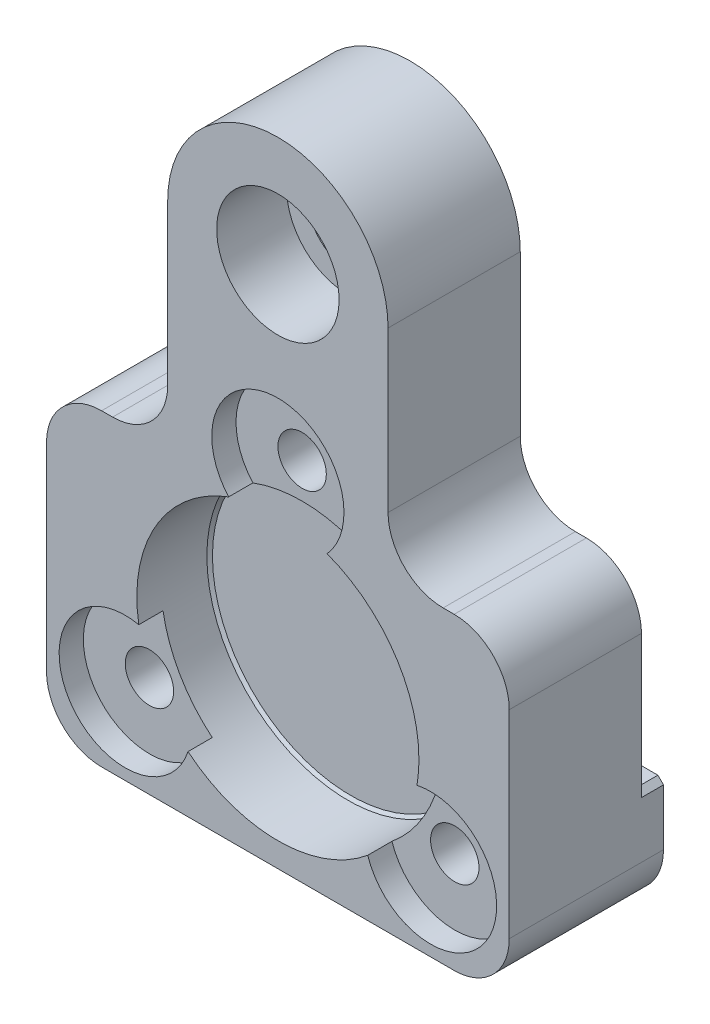
ISO-10303-21;
HEADER;
FILE_DESCRIPTION(('STEP AP214'),'2;1');
FILE_NAME('part.step','',(''),(''),'','','');
FILE_SCHEMA(('AUTOMOTIVE_DESIGN { 1 0 10303 214 1 1 1 1 }'));
ENDSEC;
DATA;
#1=APPLICATION_CONTEXT('core data for automotive mechanical design processes');
#2=APPLICATION_PROTOCOL_DEFINITION('international standard','automotive_design',2000,#1);
#3=PRODUCT_CONTEXT('',#1,'mechanical');
#4=PRODUCT('Part','Part','',(#3));
#5=PRODUCT_RELATED_PRODUCT_CATEGORY('part','',(#4));
#6=PRODUCT_DEFINITION_FORMATION('','',#4);
#7=PRODUCT_DEFINITION_CONTEXT('part definition',#1,'design');
#8=PRODUCT_DEFINITION('design','',#6,#7);
#9=PRODUCT_DEFINITION_SHAPE('','',#8);
#10=(LENGTH_UNIT() NAMED_UNIT(*) SI_UNIT(.MILLI.,.METRE.));
#11=(NAMED_UNIT(*) PLANE_ANGLE_UNIT() SI_UNIT($,.RADIAN.));
#12=(NAMED_UNIT(*) SI_UNIT($,.STERADIAN.) SOLID_ANGLE_UNIT());
#13=UNCERTAINTY_MEASURE_WITH_UNIT(LENGTH_MEASURE(1.E-05),#10,'distance_accuracy_value','');
#14=(GEOMETRIC_REPRESENTATION_CONTEXT(3) GLOBAL_UNCERTAINTY_ASSIGNED_CONTEXT((#13)) GLOBAL_UNIT_ASSIGNED_CONTEXT((#10,
#11,#12)) REPRESENTATION_CONTEXT('',''));
#15=CARTESIAN_POINT('',(0.,0.,0.));
#16=DIRECTION('',(0.,0.,1.));
#17=DIRECTION('',(1.,0.,0.));
#18=AXIS2_PLACEMENT_3D('',#15,#16,#17);
#19=CARTESIAN_POINT('',(-15.,18.,14.));
#20=DIRECTION('',(0.,0.,-1.));
#21=DIRECTION('',(-1.,0.,0.));
#22=AXIS2_PLACEMENT_3D('',#19,#20,#21);
#23=CYLINDRICAL_SURFACE('',#22,5.);
#24=CARTESIAN_POINT('',(-15.,18.,2.));
#25=DIRECTION('',(0.,0.,-1.));
#26=DIRECTION('',(-1.,0.,0.));
#27=AXIS2_PLACEMENT_3D('',#24,#25,#26);
#28=CIRCLE('',#27,5.);
#29=CARTESIAN_POINT('',(-15.,13.,2.));
#30=VERTEX_POINT('',#29);
#31=CARTESIAN_POINT('',(-10.,18.,2.));
#32=VERTEX_POINT('',#31);
#33=EDGE_CURVE('E201',#30,#32,#28,.F.);
#34=ORIENTED_EDGE('',*,*,#33,.F.);
#35=DIRECTION('',(0.,0.,-1.));
#36=VECTOR('',#35,1.);
#37=CARTESIAN_POINT('',(-15.,13.,14.));
#38=LINE('',#37,#36);
#39=CARTESIAN_POINT('',(-15.,13.,14.));
#40=VERTEX_POINT('',#39);
#41=EDGE_CURVE('E241',#40,#30,#38,.T.);
#42=ORIENTED_EDGE('',*,*,#41,.F.);
#43=CARTESIAN_POINT('',(-15.,18.,14.));
#44=DIRECTION('',(0.,0.,-1.));
#45=DIRECTION('',(1.,0.,0.));
#46=AXIS2_PLACEMENT_3D('',#43,#44,#45);
#47=CIRCLE('',#46,5.);
#48=CARTESIAN_POINT('',(-10.,18.,14.));
#49=VERTEX_POINT('',#48);
#50=EDGE_CURVE('E391',#49,#40,#47,.T.);
#51=ORIENTED_EDGE('',*,*,#50,.F.);
#52=DIRECTION('',(0.,0.,-1.));
#53=VECTOR('',#52,1.);
#54=CARTESIAN_POINT('',(-10.,18.,14.));
#55=LINE('',#54,#53);
#56=EDGE_CURVE('E420',#49,#32,#55,.T.);
#57=ORIENTED_EDGE('',*,*,#56,.T.);
#58=EDGE_LOOP('',(#34,#42,#51,#57));
#59=FACE_BOUND('',#58,.T.);
#60=ADVANCED_FACE('F33',(#59),#23,.F.);
#61=CARTESIAN_POINT('',(-16.,13.,14.));
#62=DIRECTION('',(0.,-1.,0.));
#63=DIRECTION('',(1.,0.,0.));
#64=AXIS2_PLACEMENT_3D('',#61,#62,#63);
#65=PLANE('',#64);
#66=DIRECTION('',(1.,0.,0.));
#67=VECTOR('',#66,1.);
#68=CARTESIAN_POINT('',(-16.,13.,2.));
#69=LINE('',#68,#67);
#70=CARTESIAN_POINT('',(-16.,13.,2.));
#71=VERTEX_POINT('',#70);
#72=EDGE_CURVE('E345',#71,#30,#69,.T.);
#73=ORIENTED_EDGE('',*,*,#72,.F.);
#74=DIRECTION('',(0.,0.,-1.));
#75=VECTOR('',#74,1.);
#76=CARTESIAN_POINT('',(-16.,13.,14.));
#77=LINE('',#76,#75);
#78=CARTESIAN_POINT('',(-16.,13.,14.));
#79=VERTEX_POINT('',#78);
#80=EDGE_CURVE('E238',#79,#71,#77,.T.);
#81=ORIENTED_EDGE('',*,*,#80,.F.);
#82=DIRECTION('',(-1.,0.,0.));
#83=VECTOR('',#82,1.);
#84=CARTESIAN_POINT('',(-16.,13.,14.));
#85=LINE('',#84,#83);
#86=EDGE_CURVE('E394',#40,#79,#85,.T.);
#87=ORIENTED_EDGE('',*,*,#86,.F.);
#88=ORIENTED_EDGE('',*,*,#41,.T.);
#89=EDGE_LOOP('',(#73,#81,#87,#88));
#90=FACE_BOUND('',#89,.T.);
#91=ADVANCED_FACE('F302',(#90),#65,.F.);
#92=CARTESIAN_POINT('',(-16.,8.,14.));
#93=DIRECTION('',(0.,0.,-1.));
#94=DIRECTION('',(-1.,0.,0.));
#95=AXIS2_PLACEMENT_3D('',#92,#93,#94);
#96=CYLINDRICAL_SURFACE('',#95,5.);
#97=CARTESIAN_POINT('',(-16.,8.,2.));
#98=DIRECTION('',(0.,0.,-1.));
#99=DIRECTION('',(-1.,0.,0.));
#100=AXIS2_PLACEMENT_3D('',#97,#98,#99);
#101=CIRCLE('',#100,5.);
#102=CARTESIAN_POINT('',(-21.,8.,2.));
#103=VERTEX_POINT('',#102);
#104=EDGE_CURVE('E347',#103,#71,#101,.T.);
#105=ORIENTED_EDGE('',*,*,#104,.F.);
#106=DIRECTION('',(0.,0.,-1.));
#107=VECTOR('',#106,1.);
#108=CARTESIAN_POINT('',(-21.,8.,14.));
#109=LINE('',#108,#107);
#110=CARTESIAN_POINT('',(-21.,8.,14.));
#111=VERTEX_POINT('',#110);
#112=EDGE_CURVE('E236',#111,#103,#109,.T.);
#113=ORIENTED_EDGE('',*,*,#112,.F.);
#114=CARTESIAN_POINT('',(-16.,8.,14.));
#115=DIRECTION('',(0.,0.,1.));
#116=DIRECTION('',(-1.,0.,0.));
#117=AXIS2_PLACEMENT_3D('',#114,#115,#116);
#118=CIRCLE('',#117,5.);
#119=EDGE_CURVE('E397',#79,#111,#118,.T.);
#120=ORIENTED_EDGE('',*,*,#119,.F.);
#121=ORIENTED_EDGE('',*,*,#80,.T.);
#122=EDGE_LOOP('',(#105,#113,#120,#121));
#123=FACE_BOUND('',#122,.T.);
#124=ADVANCED_FACE('F308',(#123),#96,.T.);
#125=CARTESIAN_POINT('',(16.,8.,14.));
#126=DIRECTION('',(0.,0.,-1.));
#127=DIRECTION('',(-1.,0.,0.));
#128=AXIS2_PLACEMENT_3D('',#125,#126,#127);
#129=CYLINDRICAL_SURFACE('',#128,5.);
#130=CARTESIAN_POINT('',(16.,8.,2.));
#131=DIRECTION('',(0.,0.,-1.));
#132=DIRECTION('',(-1.,0.,0.));
#133=AXIS2_PLACEMENT_3D('',#130,#131,#132);
#134=CIRCLE('',#133,5.);
#135=CARTESIAN_POINT('',(16.,13.,2.));
#136=VERTEX_POINT('',#135);
#137=CARTESIAN_POINT('',(21.,8.,2.));
#138=VERTEX_POINT('',#137);
#139=EDGE_CURVE('E193',#136,#138,#134,.T.);
#140=ORIENTED_EDGE('',*,*,#139,.F.);
#141=DIRECTION('',(0.,0.,-1.));
#142=VECTOR('',#141,1.);
#143=CARTESIAN_POINT('',(16.,13.,14.));
#144=LINE('',#143,#142);
#145=CARTESIAN_POINT('',(16.,13.,14.));
#146=VERTEX_POINT('',#145);
#147=EDGE_CURVE('E219',#146,#136,#144,.T.);
#148=ORIENTED_EDGE('',*,*,#147,.F.);
#149=CARTESIAN_POINT('',(16.,8.,14.));
#150=DIRECTION('',(0.,0.,1.));
#151=DIRECTION('',(-1.,0.,0.));
#152=AXIS2_PLACEMENT_3D('',#149,#150,#151);
#153=CIRCLE('',#152,5.);
#154=CARTESIAN_POINT('',(21.,8.00000000000001,14.));
#155=VERTEX_POINT('',#154);
#156=EDGE_CURVE('E217',#155,#146,#153,.T.);
#157=ORIENTED_EDGE('',*,*,#156,.F.);
#158=DIRECTION('',(0.,0.,-1.));
#159=VECTOR('',#158,1.);
#160=CARTESIAN_POINT('',(21.,8.00000000000001,14.));
#161=LINE('',#160,#159);
#162=EDGE_CURVE('E208',#155,#138,#161,.T.);
#163=ORIENTED_EDGE('',*,*,#162,.T.);
#164=EDGE_LOOP('',(#140,#148,#157,#163));
#165=FACE_BOUND('',#164,.T.);
#166=ADVANCED_FACE('F216',(#165),#129,.T.);
#167=CARTESIAN_POINT('',(15.,13.,14.));
#168=DIRECTION('',(0.,-1.,0.));
#169=DIRECTION('',(1.,0.,0.));
#170=AXIS2_PLACEMENT_3D('',#167,#168,#169);
#171=PLANE('',#170);
#172=DIRECTION('',(1.,0.,0.));
#173=VECTOR('',#172,1.);
#174=CARTESIAN_POINT('',(15.,13.,2.));
#175=LINE('',#174,#173);
#176=CARTESIAN_POINT('',(15.,13.,2.));
#177=VERTEX_POINT('',#176);
#178=EDGE_CURVE('E196',#177,#136,#175,.T.);
#179=ORIENTED_EDGE('',*,*,#178,.F.);
#180=DIRECTION('',(0.,0.,-1.));
#181=VECTOR('',#180,1.);
#182=CARTESIAN_POINT('',(15.,13.,14.));
#183=LINE('',#182,#181);
#184=CARTESIAN_POINT('',(15.,13.,14.));
#185=VERTEX_POINT('',#184);
#186=EDGE_CURVE('E224',#185,#177,#183,.T.);
#187=ORIENTED_EDGE('',*,*,#186,.F.);
#188=DIRECTION('',(-1.,0.,0.));
#189=VECTOR('',#188,1.);
#190=CARTESIAN_POINT('',(15.,13.,14.));
#191=LINE('',#190,#189);
#192=EDGE_CURVE('E410',#146,#185,#191,.T.);
#193=ORIENTED_EDGE('',*,*,#192,.F.);
#194=ORIENTED_EDGE('',*,*,#147,.T.);
#195=EDGE_LOOP('',(#179,#187,#193,#194));
#196=FACE_BOUND('',#195,.T.);
#197=ADVANCED_FACE('F448',(#196),#171,.F.);
#198=CARTESIAN_POINT('',(15.,18.,14.));
#199=DIRECTION('',(0.,0.,-1.));
#200=DIRECTION('',(-1.,0.,0.));
#201=AXIS2_PLACEMENT_3D('',#198,#199,#200);
#202=CYLINDRICAL_SURFACE('',#201,5.);
#203=CARTESIAN_POINT('',(15.,18.,2.));
#204=DIRECTION('',(0.,0.,-1.));
#205=DIRECTION('',(-1.,0.,0.));
#206=AXIS2_PLACEMENT_3D('',#203,#204,#205);
#207=CIRCLE('',#206,5.);
#208=CARTESIAN_POINT('',(10.,18.,2.));
#209=VERTEX_POINT('',#208);
#210=EDGE_CURVE('E341',#209,#177,#207,.F.);
#211=ORIENTED_EDGE('',*,*,#210,.F.);
#212=DIRECTION('',(0.,0.,-1.));
#213=VECTOR('',#212,1.);
#214=CARTESIAN_POINT('',(10.,18.,14.));
#215=LINE('',#214,#213);
#216=CARTESIAN_POINT('',(10.,18.,14.));
#217=VERTEX_POINT('',#216);
#218=EDGE_CURVE('E437',#217,#209,#215,.T.);
#219=ORIENTED_EDGE('',*,*,#218,.F.);
#220=CARTESIAN_POINT('',(15.,18.,14.));
#221=DIRECTION('',(0.,0.,-1.));
#222=DIRECTION('',(1.,0.,0.));
#223=AXIS2_PLACEMENT_3D('',#220,#221,#222);
#224=CIRCLE('',#223,5.);
#225=EDGE_CURVE('E412',#185,#217,#224,.T.);
#226=ORIENTED_EDGE('',*,*,#225,.F.);
#227=ORIENTED_EDGE('',*,*,#186,.T.);
#228=EDGE_LOOP('',(#211,#219,#226,#227));
#229=FACE_BOUND('',#228,.T.);
#230=ADVANCED_FACE('F444',(#229),#202,.F.);
#231=CARTESIAN_POINT('',(10.,32.5,14.));
#232=DIRECTION('',(-1.,0.,0.));
#233=DIRECTION('',(0.,-1.,0.));
#234=AXIS2_PLACEMENT_3D('',#231,#232,#233);
#235=PLANE('',#234);
#236=DIRECTION('',(0.,-1.,0.));
#237=VECTOR('',#236,1.);
#238=CARTESIAN_POINT('',(10.,32.5,2.));
#239=LINE('',#238,#237);
#240=CARTESIAN_POINT('',(10.,32.5,2.));
#241=VERTEX_POINT('',#240);
#242=EDGE_CURVE('E339',#241,#209,#239,.T.);
#243=ORIENTED_EDGE('',*,*,#242,.F.);
#244=DIRECTION('',(0.,0.,-1.));
#245=VECTOR('',#244,1.);
#246=CARTESIAN_POINT('',(10.,32.5,14.));
#247=LINE('',#246,#245);
#248=CARTESIAN_POINT('',(10.,32.5,14.));
#249=VERTEX_POINT('',#248);
#250=EDGE_CURVE('E434',#249,#241,#247,.T.);
#251=ORIENTED_EDGE('',*,*,#250,.F.);
#252=DIRECTION('',(0.,1.,0.));
#253=VECTOR('',#252,1.);
#254=CARTESIAN_POINT('',(10.,32.5,14.));
#255=LINE('',#254,#253);
#256=EDGE_CURVE('E414',#217,#249,#255,.T.);
#257=ORIENTED_EDGE('',*,*,#256,.F.);
#258=ORIENTED_EDGE('',*,*,#218,.T.);
#259=EDGE_LOOP('',(#243,#251,#257,#258));
#260=FACE_BOUND('',#259,.T.);
#261=ADVANCED_FACE('F488',(#260),#235,.F.);
#262=CARTESIAN_POINT('',(0.,32.5,14.));
#263=DIRECTION('',(0.,0.,-1.));
#264=DIRECTION('',(-1.,0.,0.));
#265=AXIS2_PLACEMENT_3D('',#262,#263,#264);
#266=CYLINDRICAL_SURFACE('',#265,10.);
#267=ORIENTED_EDGE('',*,*,#250,.T.);
#268=CARTESIAN_POINT('',(0.,32.5,2.));
#269=DIRECTION('',(0.,0.,-1.));
#270=DIRECTION('',(-1.,0.,0.));
#271=AXIS2_PLACEMENT_3D('',#268,#269,#270);
#272=CIRCLE('',#271,10.);
#273=CARTESIAN_POINT('',(-10.,32.5,2.));
#274=VERTEX_POINT('',#273);
#275=EDGE_CURVE('E337',#274,#241,#272,.T.);
#276=ORIENTED_EDGE('',*,*,#275,.F.);
#277=DIRECTION('',(0.,0.,-1.));
#278=VECTOR('',#277,1.);
#279=CARTESIAN_POINT('',(-10.,32.5,14.));
#280=LINE('',#279,#278);
#281=CARTESIAN_POINT('',(-10.,32.5,14.));
#282=VERTEX_POINT('',#281);
#283=EDGE_CURVE('E431',#282,#274,#280,.T.);
#284=ORIENTED_EDGE('',*,*,#283,.F.);
#285=CARTESIAN_POINT('',(0.,32.5,14.));
#286=DIRECTION('',(0.,0.,1.));
#287=DIRECTION('',(1.,0.,0.));
#288=AXIS2_PLACEMENT_3D('',#285,#286,#287);
#289=CIRCLE('',#288,10.);
#290=EDGE_CURVE('E416',#249,#282,#289,.T.);
#291=ORIENTED_EDGE('',*,*,#290,.F.);
#292=EDGE_LOOP('',(#267,#276,#284,#291));
#293=FACE_BOUND('',#292,.T.);
#294=ADVANCED_FACE('F483',(#293),#266,.T.);
#295=CARTESIAN_POINT('',(-10.,18.,14.));
#296=DIRECTION('',(1.,0.,0.));
#297=DIRECTION('',(0.,1.,0.));
#298=AXIS2_PLACEMENT_3D('',#295,#296,#297);
#299=PLANE('',#298);
#300=DIRECTION('',(0.,1.,0.));
#301=VECTOR('',#300,1.);
#302=CARTESIAN_POINT('',(-10.,18.,2.));
#303=LINE('',#302,#301);
#304=EDGE_CURVE('E335',#32,#274,#303,.T.);
#305=ORIENTED_EDGE('',*,*,#304,.F.);
#306=ORIENTED_EDGE('',*,*,#56,.F.);
#307=DIRECTION('',(0.,-1.,0.));
#308=VECTOR('',#307,1.);
#309=CARTESIAN_POINT('',(-10.,18.,14.));
#310=LINE('',#309,#308);
#311=EDGE_CURVE('E418',#282,#49,#310,.T.);
#312=ORIENTED_EDGE('',*,*,#311,.F.);
#313=ORIENTED_EDGE('',*,*,#283,.T.);
#314=EDGE_LOOP('',(#305,#306,#312,#313));
#315=FACE_BOUND('',#314,.T.);
#316=ADVANCED_FACE('F478',(#315),#299,.F.);
#317=CARTESIAN_POINT('',(0.,32.5,14.));
#318=DIRECTION('',(0.,0.,1.));
#319=DIRECTION('',(1.,0.,0.));
#320=AXIS2_PLACEMENT_3D('',#317,#318,#319);
#321=CYLINDRICAL_SURFACE('',#320,3.57124);
#322=CARTESIAN_POINT('',(0.,32.5,7.65));
#323=DIRECTION('',(0.,0.,1.));
#324=DIRECTION('',(1.,0.,0.));
#325=AXIS2_PLACEMENT_3D('',#322,#323,#324);
#326=CIRCLE('',#325,3.57124);
#327=CARTESIAN_POINT('',(3.57124,32.5,7.65));
#328=VERTEX_POINT('',#327);
#329=EDGE_CURVE('E382',#328,#328,#326,.T.);
#330=ORIENTED_EDGE('',*,*,#329,.T.);
#331=EDGE_LOOP('',(#330));
#332=FACE_BOUND('',#331,.T.);
#333=CARTESIAN_POINT('',(0.,32.5,2.));
#334=DIRECTION('',(0.,0.,-1.));
#335=DIRECTION('',(-1.,0.,0.));
#336=AXIS2_PLACEMENT_3D('',#333,#334,#335);
#337=CIRCLE('',#336,3.57124);
#338=CARTESIAN_POINT('',(-3.57124,32.5,2.));
#339=VERTEX_POINT('',#338);
#340=EDGE_CURVE('E272',#339,#339,#337,.F.);
#341=ORIENTED_EDGE('',*,*,#340,.F.);
#342=EDGE_LOOP('',(#341));
#343=FACE_BOUND('',#342,.T.);
#344=ADVANCED_FACE('F554',(#332,#343),#321,.F.);
#345=CARTESIAN_POINT('',(0.,16.,11.8));
#346=DIRECTION('',(0.,0.,1.));
#347=DIRECTION('',(1.,0.,0.));
#348=AXIS2_PLACEMENT_3D('',#345,#346,#347);
#349=CYLINDRICAL_SURFACE('',#348,2.1971);
#350=CARTESIAN_POINT('',(0.,16.,11.8));
#351=DIRECTION('',(0.,0.,1.));
#352=DIRECTION('',(1.,0.,0.));
#353=AXIS2_PLACEMENT_3D('',#350,#351,#352);
#354=CIRCLE('',#353,2.1971);
#355=CARTESIAN_POINT('',(2.1971,16.,11.8));
#356=VERTEX_POINT('',#355);
#357=EDGE_CURVE('E349',#356,#356,#354,.T.);
#358=ORIENTED_EDGE('',*,*,#357,.T.);
#359=EDGE_LOOP('',(#358));
#360=FACE_BOUND('',#359,.T.);
#361=CARTESIAN_POINT('',(0.,16.,2.));
#362=DIRECTION('',(0.,0.,-1.));
#363=DIRECTION('',(-1.,0.,0.));
#364=AXIS2_PLACEMENT_3D('',#361,#362,#363);
#365=CIRCLE('',#364,2.1971);
#366=CARTESIAN_POINT('',(-2.1971,16.,2.));
#367=VERTEX_POINT('',#366);
#368=EDGE_CURVE('E269',#367,#367,#365,.F.);
#369=ORIENTED_EDGE('',*,*,#368,.F.);
#370=EDGE_LOOP('',(#369));
#371=FACE_BOUND('',#370,.T.);
#372=ADVANCED_FACE('F517',(#360,#371),#349,.F.);
#373=CARTESIAN_POINT('',(-21.,8.,14.));
#374=DIRECTION('',(1.,0.,0.));
#375=DIRECTION('',(0.,0.,-1.));
#376=AXIS2_PLACEMENT_3D('',#373,#374,#375);
#377=PLANE('',#376);
#378=DIRECTION('',(0.,1.,0.));
#379=VECTOR('',#378,1.);
#380=CARTESIAN_POINT('',(-21.,42.5,2.));
#381=LINE('',#380,#379);
#382=CARTESIAN_POINT('',(-21.,-4.90799999999999,2.));
#383=VERTEX_POINT('',#382);
#384=EDGE_CURVE('E48',#383,#103,#381,.T.);
#385=ORIENTED_EDGE('',*,*,#384,.F.);
#386=DIRECTION('',(0.,0.,-1.));
#387=VECTOR('',#386,1.);
#388=CARTESIAN_POINT('',(-21.,-4.90799999999999,14.));
#389=LINE('',#388,#387);
#390=CARTESIAN_POINT('',(-21.,-4.90799999999998,0.));
#391=VERTEX_POINT('',#390);
#392=EDGE_CURVE('E282',#383,#391,#389,.T.);
#393=ORIENTED_EDGE('',*,*,#392,.T.);
#394=DIRECTION('',(0.,-1.,0.));
#395=VECTOR('',#394,1.);
#396=CARTESIAN_POINT('',(-21.,8.,0.));
#397=LINE('',#396,#395);
#398=CARTESIAN_POINT('',(-21.,-10.,0.));
#399=VERTEX_POINT('',#398);
#400=EDGE_CURVE('E389',#391,#399,#397,.T.);
#401=ORIENTED_EDGE('',*,*,#400,.T.);
#402=DIRECTION('',(0.,0.,-1.));
#403=VECTOR('',#402,1.);
#404=CARTESIAN_POINT('',(-21.,-10.,14.));
#405=LINE('',#404,#403);
#406=CARTESIAN_POINT('',(-21.,-10.,14.));
#407=VERTEX_POINT('',#406);
#408=EDGE_CURVE('E233',#407,#399,#405,.T.);
#409=ORIENTED_EDGE('',*,*,#408,.F.);
#410=DIRECTION('',(0.,-1.,0.));
#411=VECTOR('',#410,1.);
#412=CARTESIAN_POINT('',(-21.,8.,14.));
#413=LINE('',#412,#411);
#414=EDGE_CURVE('E399',#111,#407,#413,.T.);
#415=ORIENTED_EDGE('',*,*,#414,.F.);
#416=ORIENTED_EDGE('',*,*,#112,.T.);
#417=EDGE_LOOP('',(#385,#393,#401,#409,#415,#416));
#418=FACE_BOUND('',#417,.T.);
#419=ADVANCED_FACE('F468',(#418),#377,.F.);
#420=CARTESIAN_POINT('',(-16.,-10.,14.));
#421=DIRECTION('',(0.,0.,-1.));
#422=DIRECTION('',(-1.,0.,0.));
#423=AXIS2_PLACEMENT_3D('',#420,#421,#422);
#424=CYLINDRICAL_SURFACE('',#423,5.);
#425=CARTESIAN_POINT('',(-16.,-10.,0.));
#426=DIRECTION('',(0.,0.,1.));
#427=DIRECTION('',(1.,0.,0.));
#428=AXIS2_PLACEMENT_3D('',#425,#426,#427);
#429=CIRCLE('',#428,5.);
#430=CARTESIAN_POINT('',(-16.,-15.,0.));
#431=VERTEX_POINT('',#430);
#432=EDGE_CURVE('E422',#399,#431,#429,.T.);
#433=ORIENTED_EDGE('',*,*,#432,.T.);
#434=DIRECTION('',(0.,0.,-1.));
#435=VECTOR('',#434,1.);
#436=CARTESIAN_POINT('',(-16.,-15.,14.));
#437=LINE('',#436,#435);
#438=CARTESIAN_POINT('',(-16.,-15.,14.));
#439=VERTEX_POINT('',#438);
#440=EDGE_CURVE('E230',#439,#431,#437,.T.);
#441=ORIENTED_EDGE('',*,*,#440,.F.);
#442=CARTESIAN_POINT('',(-16.,-10.,14.));
#443=DIRECTION('',(0.,0.,1.));
#444=DIRECTION('',(1.,0.,0.));
#445=AXIS2_PLACEMENT_3D('',#442,#443,#444);
#446=CIRCLE('',#445,5.);
#447=EDGE_CURVE('E401',#407,#439,#446,.T.);
#448=ORIENTED_EDGE('',*,*,#447,.F.);
#449=ORIENTED_EDGE('',*,*,#408,.T.);
#450=EDGE_LOOP('',(#433,#441,#448,#449));
#451=FACE_BOUND('',#450,.T.);
#452=ADVANCED_FACE('F511',(#451),#424,.T.);
#453=CARTESIAN_POINT('',(-16.,-15.,14.));
#454=DIRECTION('',(0.,1.,0.));
#455=DIRECTION('',(-1.,0.,0.));
#456=AXIS2_PLACEMENT_3D('',#453,#454,#455);
#457=PLANE('',#456);
#458=DIRECTION('',(1.,0.,0.));
#459=VECTOR('',#458,1.);
#460=CARTESIAN_POINT('',(-16.,-15.,0.));
#461=LINE('',#460,#459);
#462=CARTESIAN_POINT('',(16.,-15.,0.));
#463=VERTEX_POINT('',#462);
#464=EDGE_CURVE('E424',#431,#463,#461,.T.);
#465=ORIENTED_EDGE('',*,*,#464,.T.);
#466=DIRECTION('',(0.,0.,-1.));
#467=VECTOR('',#466,1.);
#468=CARTESIAN_POINT('',(16.,-15.,14.));
#469=LINE('',#468,#467);
#470=CARTESIAN_POINT('',(16.,-15.,14.));
#471=VERTEX_POINT('',#470);
#472=EDGE_CURVE('E222',#471,#463,#469,.T.);
#473=ORIENTED_EDGE('',*,*,#472,.F.);
#474=DIRECTION('',(1.,0.,0.));
#475=VECTOR('',#474,1.);
#476=CARTESIAN_POINT('',(-16.,-15.,14.));
#477=LINE('',#476,#475);
#478=EDGE_CURVE('E403',#439,#471,#477,.T.);
#479=ORIENTED_EDGE('',*,*,#478,.F.);
#480=ORIENTED_EDGE('',*,*,#440,.T.);
#481=EDGE_LOOP('',(#465,#473,#479,#480));
#482=FACE_BOUND('',#481,.T.);
#483=ADVANCED_FACE('F508',(#482),#457,.F.);
#484=CARTESIAN_POINT('',(16.,-9.99999999999999,14.));
#485=DIRECTION('',(0.,0.,-1.));
#486=DIRECTION('',(-1.,0.,0.));
#487=AXIS2_PLACEMENT_3D('',#484,#485,#486);
#488=CYLINDRICAL_SURFACE('',#487,5.);
#489=CARTESIAN_POINT('',(16.,-9.99999999999999,0.));
#490=DIRECTION('',(0.,0.,1.));
#491=DIRECTION('',(1.,0.,0.));
#492=AXIS2_PLACEMENT_3D('',#489,#490,#491);
#493=CIRCLE('',#492,5.);
#494=CARTESIAN_POINT('',(21.,-9.99999999999999,0.));
#495=VERTEX_POINT('',#494);
#496=EDGE_CURVE('E426',#463,#495,#493,.T.);
#497=ORIENTED_EDGE('',*,*,#496,.T.);
#498=DIRECTION('',(0.,0.,-1.));
#499=VECTOR('',#498,1.);
#500=CARTESIAN_POINT('',(21.,-9.99999999999999,14.));
#501=LINE('',#500,#499);
#502=CARTESIAN_POINT('',(21.,-9.99999999999999,14.));
#503=VERTEX_POINT('',#502);
#504=EDGE_CURVE('E218',#503,#495,#501,.T.);
#505=ORIENTED_EDGE('',*,*,#504,.F.);
#506=CARTESIAN_POINT('',(16.,-9.99999999999999,14.));
#507=DIRECTION('',(0.,0.,1.));
#508=DIRECTION('',(1.,0.,0.));
#509=AXIS2_PLACEMENT_3D('',#506,#507,#508);
#510=CIRCLE('',#509,5.);
#511=EDGE_CURVE('E405',#471,#503,#510,.T.);
#512=ORIENTED_EDGE('',*,*,#511,.F.);
#513=ORIENTED_EDGE('',*,*,#472,.T.);
#514=EDGE_LOOP('',(#497,#505,#512,#513));
#515=FACE_BOUND('',#514,.T.);
#516=ADVANCED_FACE('F505',(#515),#488,.T.);
#517=CARTESIAN_POINT('',(21.,8.00000000000001,14.));
#518=DIRECTION('',(-1.,0.,0.));
#519=DIRECTION('',(0.,0.,1.));
#520=AXIS2_PLACEMENT_3D('',#517,#518,#519);
#521=PLANE('',#520);
#522=DIRECTION('',(0.,1.,0.));
#523=VECTOR('',#522,1.);
#524=CARTESIAN_POINT('',(21.,8.00000000000001,0.));
#525=LINE('',#524,#523);
#526=CARTESIAN_POINT('',(21.,-4.90800000000001,0.));
#527=VERTEX_POINT('',#526);
#528=EDGE_CURVE('E395',#495,#527,#525,.T.);
#529=ORIENTED_EDGE('',*,*,#528,.T.);
#530=DIRECTION('',(0.,0.,1.));
#531=VECTOR('',#530,1.);
#532=CARTESIAN_POINT('',(21.,-4.90800000000001,14.));
#533=LINE('',#532,#531);
#534=CARTESIAN_POINT('',(21.,-4.90800000000001,2.));
#535=VERTEX_POINT('',#534);
#536=EDGE_CURVE('E211',#527,#535,#533,.T.);
#537=ORIENTED_EDGE('',*,*,#536,.T.);
#538=DIRECTION('',(0.,-1.,0.));
#539=VECTOR('',#538,1.);
#540=CARTESIAN_POINT('',(21.,42.5,2.));
#541=LINE('',#540,#539);
#542=EDGE_CURVE('E56',#138,#535,#541,.T.);
#543=ORIENTED_EDGE('',*,*,#542,.F.);
#544=ORIENTED_EDGE('',*,*,#162,.F.);
#545=DIRECTION('',(0.,1.,0.));
#546=VECTOR('',#545,1.);
#547=CARTESIAN_POINT('',(21.,8.00000000000001,14.));
#548=LINE('',#547,#546);
#549=EDGE_CURVE('E407',#503,#155,#548,.T.);
#550=ORIENTED_EDGE('',*,*,#549,.F.);
#551=ORIENTED_EDGE('',*,*,#504,.T.);
#552=EDGE_LOOP('',(#529,#537,#543,#544,#550,#551));
#553=FACE_BOUND('',#552,.T.);
#554=ADVANCED_FACE('F206',(#553),#521,.F.);
#555=CARTESIAN_POINT('',(-15.,18.,14.));
#556=DIRECTION('',(0.,0.,1.));
#557=DIRECTION('',(1.,0.,0.));
#558=AXIS2_PLACEMENT_3D('',#555,#556,#557);
#559=PLANE('',#558);
#560=CARTESIAN_POINT('',(13.8564064605511,-7.99999999999987,14.));
#561=DIRECTION('',(0.,0.,1.));
#562=DIRECTION('',(-0.499999999999992,-0.866025403784443,0.));
#563=AXIS2_PLACEMENT_3D('',#560,#561,#562);
#564=CIRCLE('',#563,6.);
#565=CARTESIAN_POINT('',(8.15414532696813,-9.86660600139095,14.));
#566=VERTEX_POINT('',#565);
#567=CARTESIAN_POINT('',(12.6218041098207,-2.12839399860886,14.));
#568=VERTEX_POINT('',#567);
#569=EDGE_CURVE('E364',#566,#568,#564,.T.);
#570=ORIENTED_EDGE('',*,*,#569,.F.);
#571=CARTESIAN_POINT('',(0.,0.,14.));
#572=DIRECTION('',(0.,0.,1.));
#573=DIRECTION('',(1.,0.,0.));
#574=AXIS2_PLACEMENT_3D('',#571,#572,#573);
#575=CIRCLE('',#574,12.8);
#576=CARTESIAN_POINT('',(-8.154145326968,-9.86660600139106,14.));
#577=VERTEX_POINT('',#576);
#578=EDGE_CURVE('E390',#577,#566,#575,.T.);
#579=ORIENTED_EDGE('',*,*,#578,.F.);
#580=CARTESIAN_POINT('',(-13.856406460551,-8.00000000000007,14.));
#581=DIRECTION('',(0.,0.,1.));
#582=DIRECTION('',(-0.500000000000004,0.866025403784436,0.));
#583=AXIS2_PLACEMENT_3D('',#580,#581,#582);
#584=CIRCLE('',#583,6.);
#585=CARTESIAN_POINT('',(-12.6218041098206,-2.12839399860904,14.));
#586=VERTEX_POINT('',#585);
#587=EDGE_CURVE('E367',#586,#577,#584,.T.);
#588=ORIENTED_EDGE('',*,*,#587,.F.);
#589=CARTESIAN_POINT('',(-4.4676587828526,11.995,14.));
#590=VERTEX_POINT('',#589);
#591=EDGE_CURVE('E386',#590,#586,#575,.T.);
#592=ORIENTED_EDGE('',*,*,#591,.F.);
#593=CARTESIAN_POINT('',(0.,16.,14.));
#594=DIRECTION('',(0.,0.,1.));
#595=DIRECTION('',(1.,0.,0.));
#596=AXIS2_PLACEMENT_3D('',#593,#594,#595);
#597=CIRCLE('',#596,6.);
#598=CARTESIAN_POINT('',(4.4676587828526,11.995,14.));
#599=VERTEX_POINT('',#598);
#600=EDGE_CURVE('E371',#599,#590,#597,.T.);
#601=ORIENTED_EDGE('',*,*,#600,.F.);
#602=EDGE_CURVE('E385',#568,#599,#575,.T.);
#603=ORIENTED_EDGE('',*,*,#602,.F.);
#604=EDGE_LOOP('',(#570,#579,#588,#592,#601,#603));
#605=FACE_BOUND('',#604,.T.);
#606=CARTESIAN_POINT('',(0.,32.5,14.));
#607=DIRECTION('',(0.,0.,1.));
#608=DIRECTION('',(1.,0.,0.));
#609=AXIS2_PLACEMENT_3D('',#606,#607,#608);
#610=CIRCLE('',#609,5.55625);
#611=CARTESIAN_POINT('',(5.55625,32.5,14.));
#612=VERTEX_POINT('',#611);
#613=EDGE_CURVE('E375',#612,#612,#610,.T.);
#614=ORIENTED_EDGE('',*,*,#613,.F.);
#615=EDGE_LOOP('',(#614));
#616=FACE_BOUND('',#615,.T.);
#617=ORIENTED_EDGE('',*,*,#50,.T.);
#618=ORIENTED_EDGE('',*,*,#86,.T.);
#619=ORIENTED_EDGE('',*,*,#119,.T.);
#620=ORIENTED_EDGE('',*,*,#414,.T.);
#621=ORIENTED_EDGE('',*,*,#447,.T.);
#622=ORIENTED_EDGE('',*,*,#478,.T.);
#623=ORIENTED_EDGE('',*,*,#511,.T.);
#624=ORIENTED_EDGE('',*,*,#549,.T.);
#625=ORIENTED_EDGE('',*,*,#156,.T.);
#626=ORIENTED_EDGE('',*,*,#192,.T.);
#627=ORIENTED_EDGE('',*,*,#225,.T.);
#628=ORIENTED_EDGE('',*,*,#256,.T.);
#629=ORIENTED_EDGE('',*,*,#290,.T.);
#630=ORIENTED_EDGE('',*,*,#311,.T.);
#631=EDGE_LOOP('',(#617,#618,#619,#620,#621,#622,#623,#624,#625,#626,#627,#628,#629,#630));
#632=FACE_BOUND('',#631,.T.);
#633=ADVANCED_FACE('F450',(#605,#616,#632),#559,.T.);
#634=CARTESIAN_POINT('',(-15.,18.,0.));
#635=DIRECTION('',(0.,0.,1.));
#636=DIRECTION('',(1.,0.,0.));
#637=AXIS2_PLACEMENT_3D('',#634,#635,#636);
#638=PLANE('',#637);
#639=CARTESIAN_POINT('',(-13.856406460551,-8.00000000000007,0.));
#640=DIRECTION('',(0.,0.,1.));
#641=DIRECTION('',(1.,0.,0.));
#642=AXIS2_PLACEMENT_3D('',#639,#640,#641);
#643=CIRCLE('',#642,2.1971);
#644=CARTESIAN_POINT('',(-11.659306460551,-8.00000000000007,0.));
#645=VERTEX_POINT('',#644);
#646=EDGE_CURVE('E355',#645,#645,#643,.T.);
#647=ORIENTED_EDGE('',*,*,#646,.T.);
#648=EDGE_LOOP('',(#647));
#649=FACE_BOUND('',#648,.T.);
#650=CARTESIAN_POINT('',(13.8564064605511,-7.99999999999987,0.));
#651=DIRECTION('',(0.,0.,1.));
#652=DIRECTION('',(1.,0.,0.));
#653=AXIS2_PLACEMENT_3D('',#650,#651,#652);
#654=CIRCLE('',#653,2.1971);
#655=CARTESIAN_POINT('',(16.0535064605511,-7.99999999999987,0.));
#656=VERTEX_POINT('',#655);
#657=EDGE_CURVE('E361',#656,#656,#654,.T.);
#658=ORIENTED_EDGE('',*,*,#657,.T.);
#659=EDGE_LOOP('',(#658));
#660=FACE_BOUND('',#659,.T.);
#661=DIRECTION('',(-1.,0.,0.));
#662=VECTOR('',#661,1.);
#663=CARTESIAN_POINT('',(21.,-4.4,0.));
#664=LINE('',#663,#662);
#665=CARTESIAN_POINT('',(20.492,-4.4,0.));
#666=VERTEX_POINT('',#665);
#667=CARTESIAN_POINT('',(-20.492,-4.4,0.));
#668=VERTEX_POINT('',#667);
#669=EDGE_CURVE('E214',#666,#668,#664,.T.);
#670=ORIENTED_EDGE('',*,*,#669,.F.);
#671=DIRECTION('',(-0.707106781186548,0.707106781186548,0.));
#672=VECTOR('',#671,1.);
#673=CARTESIAN_POINT('',(20.492,-4.4,0.));
#674=LINE('',#673,#672);
#675=EDGE_CURVE('E279',#666,#527,#674,.F.);
#676=ORIENTED_EDGE('',*,*,#675,.T.);
#677=ORIENTED_EDGE('',*,*,#528,.F.);
#678=ORIENTED_EDGE('',*,*,#496,.F.);
#679=ORIENTED_EDGE('',*,*,#464,.F.);
#680=ORIENTED_EDGE('',*,*,#432,.F.);
#681=ORIENTED_EDGE('',*,*,#400,.F.);
#682=DIRECTION('',(-0.707106781186548,-0.707106781186548,0.));
#683=VECTOR('',#682,1.);
#684=CARTESIAN_POINT('',(-21.,-4.90799999999999,0.));
#685=LINE('',#684,#683);
#686=EDGE_CURVE('E277',#391,#668,#685,.F.);
#687=ORIENTED_EDGE('',*,*,#686,.T.);
#688=EDGE_LOOP('',(#670,#676,#677,#678,#679,#680,#681,#687));
#689=FACE_BOUND('',#688,.T.);
#690=ADVANCED_FACE('F457',(#649,#660,#689),#638,.F.);
#691=CARTESIAN_POINT('',(0.,0.,7.392));
#692=DIRECTION('',(0.,0.,1.));
#693=DIRECTION('',(1.,0.,0.));
#694=AXIS2_PLACEMENT_3D('',#691,#692,#693);
#695=CYLINDRICAL_SURFACE('',#694,12.8);
#696=CARTESIAN_POINT('',(0.,0.,7.646));
#697=DIRECTION('',(0.,0.,1.));
#698=DIRECTION('',(1.,0.,0.));
#699=AXIS2_PLACEMENT_3D('',#696,#697,#698);
#700=CIRCLE('',#699,12.8);
#701=CARTESIAN_POINT('',(12.8,0.,7.646));
#702=VERTEX_POINT('',#701);
#703=EDGE_CURVE('E11',#702,#702,#700,.F.);
#704=ORIENTED_EDGE('',*,*,#703,.T.);
#705=EDGE_LOOP('',(#704));
#706=FACE_BOUND('',#705,.T.);
#707=CARTESIAN_POINT('',(0.,0.,11.8));
#708=DIRECTION('',(0.,0.,1.));
#709=DIRECTION('',(1.,0.,0.));
#710=AXIS2_PLACEMENT_3D('',#707,#708,#709);
#711=CIRCLE('',#710,12.8);
#712=CARTESIAN_POINT('',(12.6218041098207,-2.12839399860886,11.8));
#713=VERTEX_POINT('',#712);
#714=CARTESIAN_POINT('',(8.15414532696813,-9.86660600139095,11.8));
#715=VERTEX_POINT('',#714);
#716=EDGE_CURVE('E260',#713,#715,#711,.F.);
#717=ORIENTED_EDGE('',*,*,#716,.F.);
#718=DIRECTION('',(0.,0.,1.));
#719=VECTOR('',#718,1.);
#720=CARTESIAN_POINT('',(12.6218041098207,-2.12839399860886,12.9));
#721=LINE('',#720,#719);
#722=EDGE_CURVE('E265',#713,#568,#721,.T.);
#723=ORIENTED_EDGE('',*,*,#722,.T.);
#724=ORIENTED_EDGE('',*,*,#602,.T.);
#725=DIRECTION('',(0.,0.,1.));
#726=VECTOR('',#725,1.);
#727=CARTESIAN_POINT('',(4.4676587828526,11.995,12.9));
#728=LINE('',#727,#726);
#729=CARTESIAN_POINT('',(4.4676587828526,11.995,11.8));
#730=VERTEX_POINT('',#729);
#731=EDGE_CURVE('E246',#599,#730,#728,.F.);
#732=ORIENTED_EDGE('',*,*,#731,.T.);
#733=CARTESIAN_POINT('',(0.,0.,11.8));
#734=DIRECTION('',(0.,0.,1.));
#735=DIRECTION('',(1.,0.,0.));
#736=AXIS2_PLACEMENT_3D('',#733,#734,#735);
#737=CIRCLE('',#736,12.8);
#738=CARTESIAN_POINT('',(-4.4676587828526,11.995,11.8));
#739=VERTEX_POINT('',#738);
#740=EDGE_CURVE('E244',#739,#730,#737,.F.);
#741=ORIENTED_EDGE('',*,*,#740,.F.);
#742=DIRECTION('',(0.,0.,1.));
#743=VECTOR('',#742,1.);
#744=CARTESIAN_POINT('',(-4.4676587828526,11.995,12.9));
#745=LINE('',#744,#743);
#746=EDGE_CURVE('E249',#739,#590,#745,.T.);
#747=ORIENTED_EDGE('',*,*,#746,.T.);
#748=ORIENTED_EDGE('',*,*,#591,.T.);
#749=DIRECTION('',(0.,0.,1.));
#750=VECTOR('',#749,1.);
#751=CARTESIAN_POINT('',(-12.6218041098206,-2.12839399860904,12.9));
#752=LINE('',#751,#750);
#753=CARTESIAN_POINT('',(-12.6218041098206,-2.12839399860904,11.8));
#754=VERTEX_POINT('',#753);
#755=EDGE_CURVE('E254',#586,#754,#752,.F.);
#756=ORIENTED_EDGE('',*,*,#755,.T.);
#757=CARTESIAN_POINT('',(0.,0.,11.8));
#758=DIRECTION('',(0.,0.,1.));
#759=DIRECTION('',(1.,0.,0.));
#760=AXIS2_PLACEMENT_3D('',#757,#758,#759);
#761=CIRCLE('',#760,12.8);
#762=CARTESIAN_POINT('',(-8.154145326968,-9.86660600139106,11.8));
#763=VERTEX_POINT('',#762);
#764=EDGE_CURVE('E252',#763,#754,#761,.F.);
#765=ORIENTED_EDGE('',*,*,#764,.F.);
#766=DIRECTION('',(0.,0.,1.));
#767=VECTOR('',#766,1.);
#768=CARTESIAN_POINT('',(-8.154145326968,-9.86660600139105,12.9));
#769=LINE('',#768,#767);
#770=EDGE_CURVE('E257',#763,#577,#769,.T.);
#771=ORIENTED_EDGE('',*,*,#770,.T.);
#772=ORIENTED_EDGE('',*,*,#578,.T.);
#773=DIRECTION('',(0.,0.,1.));
#774=VECTOR('',#773,1.);
#775=CARTESIAN_POINT('',(8.15414532696813,-9.86660600139095,12.9));
#776=LINE('',#775,#774);
#777=EDGE_CURVE('E262',#566,#715,#776,.F.);
#778=ORIENTED_EDGE('',*,*,#777,.T.);
#779=EDGE_LOOP('',(#717,#723,#724,#732,#741,#747,#748,#756,#765,#771,#772,#778));
#780=FACE_BOUND('',#779,.T.);
#781=ADVANCED_FACE('F597',(#706,#780),#695,.F.);
#782=CARTESIAN_POINT('',(0.,0.,7.392));
#783=DIRECTION('',(0.,0.,1.));
#784=DIRECTION('',(1.,0.,0.));
#785=AXIS2_PLACEMENT_3D('',#782,#783,#784);
#786=PLANE('',#785);
#787=CARTESIAN_POINT('',(0.,0.,7.392));
#788=DIRECTION('',(0.,0.,1.));
#789=DIRECTION('',(1.,0.,0.));
#790=AXIS2_PLACEMENT_3D('',#787,#788,#789);
#791=CIRCLE('',#790,12.546);
#792=CARTESIAN_POINT('',(12.546,0.,7.392));
#793=VERTEX_POINT('',#792);
#794=EDGE_CURVE('E41',#793,#793,#791,.T.);
#795=ORIENTED_EDGE('',*,*,#794,.T.);
#796=EDGE_LOOP('',(#795));
#797=FACE_BOUND('',#796,.T.);
#798=ADVANCED_FACE('F290',(#797),#786,.T.);
#799=CARTESIAN_POINT('',(3.57124,32.5,7.65));
#800=DIRECTION('',(0.,0.,-1.));
#801=DIRECTION('',(-1.,0.,0.));
#802=AXIS2_PLACEMENT_3D('',#799,#800,#801);
#803=PLANE('',#802);
#804=ORIENTED_EDGE('',*,*,#329,.F.);
#805=EDGE_LOOP('',(#804));
#806=FACE_BOUND('',#805,.T.);
#807=CARTESIAN_POINT('',(0.,32.5,7.65));
#808=DIRECTION('',(0.,0.,1.));
#809=DIRECTION('',(1.,0.,0.));
#810=AXIS2_PLACEMENT_3D('',#807,#808,#809);
#811=CIRCLE('',#810,5.55625);
#812=CARTESIAN_POINT('',(5.55625,32.5,7.65));
#813=VERTEX_POINT('',#812);
#814=EDGE_CURVE('E379',#813,#813,#811,.T.);
#815=ORIENTED_EDGE('',*,*,#814,.T.);
#816=EDGE_LOOP('',(#815));
#817=FACE_BOUND('',#816,.T.);
#818=ADVANCED_FACE('F644',(#806,#817),#803,.F.);
#819=CARTESIAN_POINT('',(0.,32.5,14.));
#820=DIRECTION('',(0.,0.,1.));
#821=DIRECTION('',(1.,0.,0.));
#822=AXIS2_PLACEMENT_3D('',#819,#820,#821);
#823=CYLINDRICAL_SURFACE('',#822,5.55625);
#824=ORIENTED_EDGE('',*,*,#814,.F.);
#825=EDGE_LOOP('',(#824));
#826=FACE_BOUND('',#825,.T.);
#827=ORIENTED_EDGE('',*,*,#613,.T.);
#828=EDGE_LOOP('',(#827));
#829=FACE_BOUND('',#828,.T.);
#830=ADVANCED_FACE('F657',(#826,#829),#823,.F.);
#831=CARTESIAN_POINT('',(0.,16.,11.8));
#832=DIRECTION('',(0.,0.,1.));
#833=DIRECTION('',(1.,0.,0.));
#834=AXIS2_PLACEMENT_3D('',#831,#832,#833);
#835=CYLINDRICAL_SURFACE('',#834,6.);
#836=CARTESIAN_POINT('',(0.,16.,11.8));
#837=DIRECTION('',(0.,0.,1.));
#838=DIRECTION('',(1.,0.,0.));
#839=AXIS2_PLACEMENT_3D('',#836,#837,#838);
#840=CIRCLE('',#839,6.);
#841=EDGE_CURVE('E373',#730,#739,#840,.T.);
#842=ORIENTED_EDGE('',*,*,#841,.F.);
#843=ORIENTED_EDGE('',*,*,#731,.F.);
#844=ORIENTED_EDGE('',*,*,#600,.T.);
#845=ORIENTED_EDGE('',*,*,#746,.F.);
#846=EDGE_LOOP('',(#842,#843,#844,#845));
#847=FACE_BOUND('',#846,.T.);
#848=ADVANCED_FACE('F665',(#847),#835,.F.);
#849=CARTESIAN_POINT('',(0.,16.,11.8));
#850=DIRECTION('',(0.,0.,1.));
#851=DIRECTION('',(1.,0.,0.));
#852=AXIS2_PLACEMENT_3D('',#849,#850,#851);
#853=PLANE('',#852);
#854=ORIENTED_EDGE('',*,*,#357,.F.);
#855=EDGE_LOOP('',(#854));
#856=FACE_BOUND('',#855,.T.);
#857=ORIENTED_EDGE('',*,*,#740,.T.);
#858=ORIENTED_EDGE('',*,*,#841,.T.);
#859=EDGE_LOOP('',(#857,#858));
#860=FACE_BOUND('',#859,.T.);
#861=ADVANCED_FACE('F673',(#856,#860),#853,.T.);
#862=CARTESIAN_POINT('',(-13.856406460551,-8.00000000000007,11.8));
#863=DIRECTION('',(0.,0.,1.));
#864=DIRECTION('',(1.,0.,0.));
#865=AXIS2_PLACEMENT_3D('',#862,#863,#864);
#866=CYLINDRICAL_SURFACE('',#865,6.);
#867=CARTESIAN_POINT('',(-13.856406460551,-8.00000000000007,11.8));
#868=DIRECTION('',(0.,0.,1.));
#869=DIRECTION('',(-0.500000000000004,0.866025403784436,0.));
#870=AXIS2_PLACEMENT_3D('',#867,#868,#869);
#871=CIRCLE('',#870,6.);
#872=EDGE_CURVE('E369',#754,#763,#871,.T.);
#873=ORIENTED_EDGE('',*,*,#872,.F.);
#874=ORIENTED_EDGE('',*,*,#755,.F.);
#875=ORIENTED_EDGE('',*,*,#587,.T.);
#876=ORIENTED_EDGE('',*,*,#770,.F.);
#877=EDGE_LOOP('',(#873,#874,#875,#876));
#878=FACE_BOUND('',#877,.T.);
#879=ADVANCED_FACE('F682',(#878),#866,.F.);
#880=CARTESIAN_POINT('',(-13.856406460551,-8.00000000000007,11.8));
#881=DIRECTION('',(0.,0.,1.));
#882=DIRECTION('',(-0.500000000000004,0.866025403784436,0.));
#883=AXIS2_PLACEMENT_3D('',#880,#881,#882);
#884=PLANE('',#883);
#885=CARTESIAN_POINT('',(-13.856406460551,-8.00000000000007,11.8));
#886=DIRECTION('',(0.,0.,1.));
#887=DIRECTION('',(1.,0.,0.));
#888=AXIS2_PLACEMENT_3D('',#885,#886,#887);
#889=CIRCLE('',#888,2.1971);
#890=CARTESIAN_POINT('',(-11.659306460551,-8.00000000000007,11.8));
#891=VERTEX_POINT('',#890);
#892=EDGE_CURVE('E352',#891,#891,#889,.T.);
#893=ORIENTED_EDGE('',*,*,#892,.F.);
#894=EDGE_LOOP('',(#893));
#895=FACE_BOUND('',#894,.T.);
#896=ORIENTED_EDGE('',*,*,#764,.T.);
#897=ORIENTED_EDGE('',*,*,#872,.T.);
#898=EDGE_LOOP('',(#896,#897));
#899=FACE_BOUND('',#898,.T.);
#900=ADVANCED_FACE('F692',(#895,#899),#884,.T.);
#901=CARTESIAN_POINT('',(13.8564064605511,-7.99999999999987,11.8));
#902=DIRECTION('',(0.,0.,1.));
#903=DIRECTION('',(1.,0.,0.));
#904=AXIS2_PLACEMENT_3D('',#901,#902,#903);
#905=CYLINDRICAL_SURFACE('',#904,6.);
#906=CARTESIAN_POINT('',(13.8564064605511,-7.99999999999987,11.8));
#907=DIRECTION('',(0.,0.,1.));
#908=DIRECTION('',(-0.499999999999992,-0.866025403784443,0.));
#909=AXIS2_PLACEMENT_3D('',#906,#907,#908);
#910=CIRCLE('',#909,6.);
#911=EDGE_CURVE('E365',#715,#713,#910,.T.);
#912=ORIENTED_EDGE('',*,*,#911,.F.);
#913=ORIENTED_EDGE('',*,*,#777,.F.);
#914=ORIENTED_EDGE('',*,*,#569,.T.);
#915=ORIENTED_EDGE('',*,*,#722,.F.);
#916=EDGE_LOOP('',(#912,#913,#914,#915));
#917=FACE_BOUND('',#916,.T.);
#918=ADVANCED_FACE('F699',(#917),#905,.F.);
#919=CARTESIAN_POINT('',(13.8564064605511,-7.99999999999987,11.8));
#920=DIRECTION('',(0.,0.,1.));
#921=DIRECTION('',(-0.499999999999992,-0.866025403784443,0.));
#922=AXIS2_PLACEMENT_3D('',#919,#920,#921);
#923=PLANE('',#922);
#924=CARTESIAN_POINT('',(13.8564064605511,-7.99999999999987,11.8));
#925=DIRECTION('',(0.,0.,1.));
#926=DIRECTION('',(1.,0.,0.));
#927=AXIS2_PLACEMENT_3D('',#924,#925,#926);
#928=CIRCLE('',#927,2.1971);
#929=CARTESIAN_POINT('',(16.0535064605511,-7.99999999999987,11.8));
#930=VERTEX_POINT('',#929);
#931=EDGE_CURVE('E358',#930,#930,#928,.T.);
#932=ORIENTED_EDGE('',*,*,#931,.F.);
#933=EDGE_LOOP('',(#932));
#934=FACE_BOUND('',#933,.T.);
#935=ORIENTED_EDGE('',*,*,#716,.T.);
#936=ORIENTED_EDGE('',*,*,#911,.T.);
#937=EDGE_LOOP('',(#935,#936));
#938=FACE_BOUND('',#937,.T.);
#939=ADVANCED_FACE('F707',(#934,#938),#923,.T.);
#940=CARTESIAN_POINT('',(13.8564064605511,-7.99999999999987,11.8));
#941=DIRECTION('',(0.,0.,1.));
#942=DIRECTION('',(1.,0.,0.));
#943=AXIS2_PLACEMENT_3D('',#940,#941,#942);
#944=CYLINDRICAL_SURFACE('',#943,2.1971);
#945=ORIENTED_EDGE('',*,*,#931,.T.);
#946=EDGE_LOOP('',(#945));
#947=FACE_BOUND('',#946,.T.);
#948=ORIENTED_EDGE('',*,*,#657,.F.);
#949=EDGE_LOOP('',(#948));
#950=FACE_BOUND('',#949,.T.);
#951=ADVANCED_FACE('F714',(#947,#950),#944,.F.);
#952=CARTESIAN_POINT('',(-13.856406460551,-8.00000000000007,11.8));
#953=DIRECTION('',(0.,0.,1.));
#954=DIRECTION('',(1.,0.,0.));
#955=AXIS2_PLACEMENT_3D('',#952,#953,#954);
#956=CYLINDRICAL_SURFACE('',#955,2.1971);
#957=ORIENTED_EDGE('',*,*,#892,.T.);
#958=EDGE_LOOP('',(#957));
#959=FACE_BOUND('',#958,.T.);
#960=ORIENTED_EDGE('',*,*,#646,.F.);
#961=EDGE_LOOP('',(#960));
#962=FACE_BOUND('',#961,.T.);
#963=ADVANCED_FACE('F609',(#959,#962),#956,.F.);
#964=CARTESIAN_POINT('',(21.,-4.4,2.));
#965=DIRECTION('',(0.,0.,-1.));
#966=DIRECTION('',(-1.,0.,0.));
#967=AXIS2_PLACEMENT_3D('',#964,#965,#966);
#968=PLANE('',#967);
#969=ORIENTED_EDGE('',*,*,#368,.T.);
#970=EDGE_LOOP('',(#969));
#971=FACE_BOUND('',#970,.T.);
#972=ORIENTED_EDGE('',*,*,#340,.T.);
#973=EDGE_LOOP('',(#972));
#974=FACE_BOUND('',#973,.T.);
#975=ORIENTED_EDGE('',*,*,#104,.T.);
#976=ORIENTED_EDGE('',*,*,#72,.T.);
#977=ORIENTED_EDGE('',*,*,#33,.T.);
#978=ORIENTED_EDGE('',*,*,#304,.T.);
#979=ORIENTED_EDGE('',*,*,#275,.T.);
#980=ORIENTED_EDGE('',*,*,#242,.T.);
#981=ORIENTED_EDGE('',*,*,#210,.T.);
#982=ORIENTED_EDGE('',*,*,#178,.T.);
#983=ORIENTED_EDGE('',*,*,#139,.T.);
#984=ORIENTED_EDGE('',*,*,#542,.T.);
#985=DIRECTION('',(0.707106781186548,-0.707106781186548,0.));
#986=VECTOR('',#985,1.);
#987=CARTESIAN_POINT('',(20.492,-4.4,2.));
#988=LINE('',#987,#986);
#989=CARTESIAN_POINT('',(20.492,-4.4,2.));
#990=VERTEX_POINT('',#989);
#991=EDGE_CURVE('E284',#535,#990,#988,.F.);
#992=ORIENTED_EDGE('',*,*,#991,.T.);
#993=DIRECTION('',(-1.,0.,0.));
#994=VECTOR('',#993,1.);
#995=CARTESIAN_POINT('',(21.,-4.4,2.));
#996=LINE('',#995,#994);
#997=CARTESIAN_POINT('',(-20.492,-4.4,2.));
#998=VERTEX_POINT('',#997);
#999=EDGE_CURVE('E213',#990,#998,#996,.T.);
#1000=ORIENTED_EDGE('',*,*,#999,.T.);
#1001=DIRECTION('',(0.707106781186548,0.707106781186548,0.));
#1002=VECTOR('',#1001,1.);
#1003=CARTESIAN_POINT('',(-21.,-4.90799999999999,2.));
#1004=LINE('',#1003,#1002);
#1005=EDGE_CURVE('E286',#998,#383,#1004,.F.);
#1006=ORIENTED_EDGE('',*,*,#1005,.T.);
#1007=ORIENTED_EDGE('',*,*,#384,.T.);
#1008=EDGE_LOOP('',(#975,#976,#977,#978,#979,#980,#981,#982,#983,#984,#992,#1000,#1006,#1007));
#1009=FACE_BOUND('',#1008,.T.);
#1010=ADVANCED_FACE('F194',(#971,#974,#1009),#968,.T.);
#1011=CARTESIAN_POINT('',(21.,-4.4,2.));
#1012=DIRECTION('',(0.,-1.,0.));
#1013=DIRECTION('',(0.,0.,-1.));
#1014=AXIS2_PLACEMENT_3D('',#1011,#1012,#1013);
#1015=PLANE('',#1014);
#1016=ORIENTED_EDGE('',*,*,#999,.F.);
#1017=DIRECTION('',(0.,0.,-1.));
#1018=VECTOR('',#1017,1.);
#1019=CARTESIAN_POINT('',(20.492,-4.4,2.));
#1020=LINE('',#1019,#1018);
#1021=EDGE_CURVE('E274',#990,#666,#1020,.T.);
#1022=ORIENTED_EDGE('',*,*,#1021,.T.);
#1023=ORIENTED_EDGE('',*,*,#669,.T.);
#1024=DIRECTION('',(0.,0.,1.));
#1025=VECTOR('',#1024,1.);
#1026=CARTESIAN_POINT('',(-20.492,-4.4,2.));
#1027=LINE('',#1026,#1025);
#1028=EDGE_CURVE('E268',#668,#998,#1027,.T.);
#1029=ORIENTED_EDGE('',*,*,#1028,.T.);
#1030=EDGE_LOOP('',(#1016,#1022,#1023,#1029));
#1031=FACE_BOUND('',#1030,.T.);
#1032=ADVANCED_FACE('F315',(#1031),#1015,.F.);
#1033=CARTESIAN_POINT('',(20.492,-4.4,2.));
#1034=DIRECTION('',(-0.707106781186547,-0.707106781186547,0.));
#1035=DIRECTION('',(0.707106781186548,-0.707106781186548,0.));
#1036=AXIS2_PLACEMENT_3D('',#1033,#1034,#1035);
#1037=PLANE('',#1036);
#1038=ORIENTED_EDGE('',*,*,#991,.F.);
#1039=ORIENTED_EDGE('',*,*,#536,.F.);
#1040=ORIENTED_EDGE('',*,*,#675,.F.);
#1041=ORIENTED_EDGE('',*,*,#1021,.F.);
#1042=EDGE_LOOP('',(#1038,#1039,#1040,#1041));
#1043=FACE_BOUND('',#1042,.T.);
#1044=ADVANCED_FACE('F298',(#1043),#1037,.F.);
#1045=CARTESIAN_POINT('',(-21.,-4.90799999999999,14.));
#1046=DIRECTION('',(0.707106781186547,-0.707106781186547,0.));
#1047=DIRECTION('',(0.707106781186548,0.707106781186548,0.));
#1048=AXIS2_PLACEMENT_3D('',#1045,#1046,#1047);
#1049=PLANE('',#1048);
#1050=ORIENTED_EDGE('',*,*,#1005,.F.);
#1051=ORIENTED_EDGE('',*,*,#1028,.F.);
#1052=ORIENTED_EDGE('',*,*,#686,.F.);
#1053=ORIENTED_EDGE('',*,*,#392,.F.);
#1054=EDGE_LOOP('',(#1050,#1051,#1052,#1053));
#1055=FACE_BOUND('',#1054,.T.);
#1056=ADVANCED_FACE('F293',(#1055),#1049,.F.);
#1057=CARTESIAN_POINT('',(0.,0.,7.392));
#1058=DIRECTION('',(0.,0.,1.));
#1059=DIRECTION('',(1.,0.,0.));
#1060=AXIS2_PLACEMENT_3D('',#1057,#1058,#1059);
#1061=CONICAL_SURFACE('',#1060,12.546,0.785398163397465);
#1062=ORIENTED_EDGE('',*,*,#703,.F.);
#1063=EDGE_LOOP('',(#1062));
#1064=FACE_BOUND('',#1063,.T.);
#1065=ORIENTED_EDGE('',*,*,#794,.F.);
#1066=EDGE_LOOP('',(#1065));
#1067=FACE_BOUND('',#1066,.T.);
#1068=ADVANCED_FACE('F35',(#1064,#1067),#1061,.F.);
#1069=CLOSED_SHELL('',(#60,#91,#124,#166,#197,#230,#261,#294,#316,#344,#372,#419,#452,#483,#516,
#554,#633,#690,#781,#798,#818,#830,#848,#861,#879,#900,#918,#939,#951,#963,#1010,#1032,#1044,
#1056,#1068));
#1070=MANIFOLD_SOLID_BREP('B2',#1069);
#1071=ADVANCED_BREP_SHAPE_REPRESENTATION('',(#18,#1070),#14);
#1072=SHAPE_DEFINITION_REPRESENTATION(#9,#1071);
ENDSEC;
END-ISO-10303-21;
